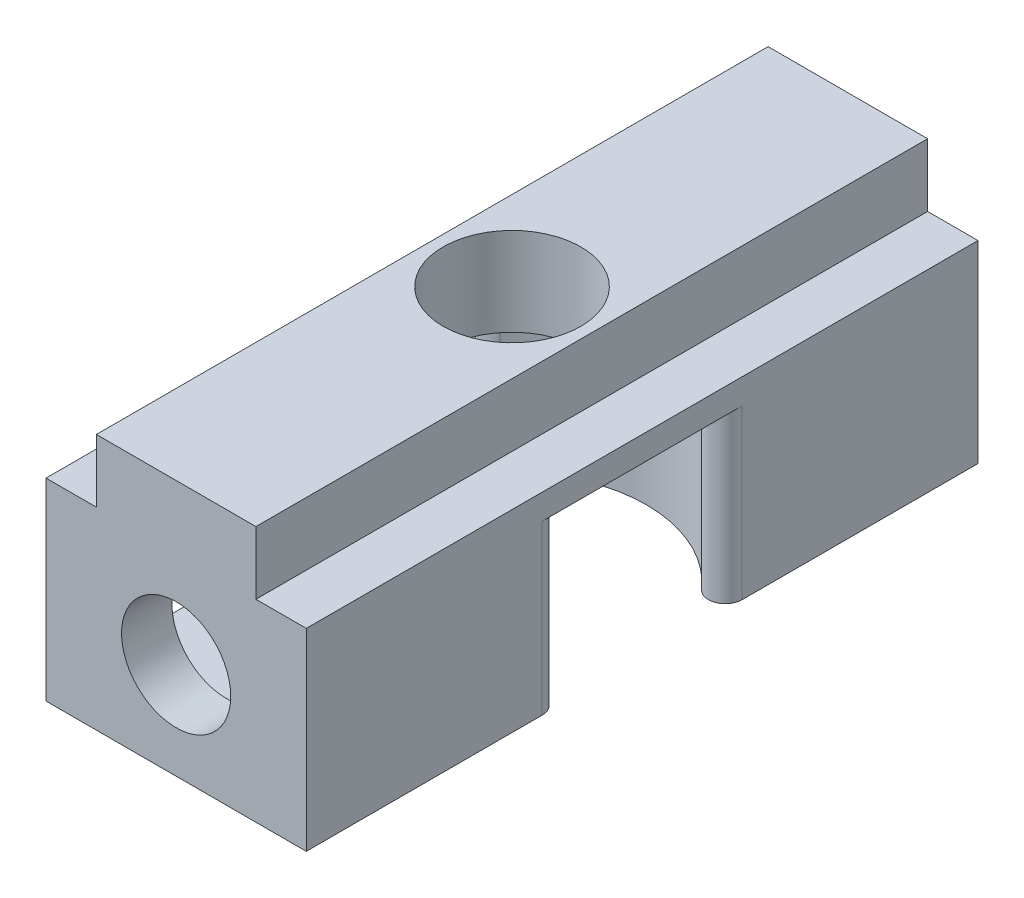
ISO-10303-21;
HEADER;
FILE_DESCRIPTION(('STEP AP214'),'2;1');
FILE_NAME('part.step','',(''),(''),'','','');
FILE_SCHEMA(('AUTOMOTIVE_DESIGN { 1 0 10303 214 1 1 1 1 }'));
ENDSEC;
DATA;
#1=APPLICATION_CONTEXT('core data for automotive mechanical design processes');
#2=APPLICATION_PROTOCOL_DEFINITION('international standard','automotive_design',2000,#1);
#3=PRODUCT_CONTEXT('',#1,'mechanical');
#4=PRODUCT('Part','Part','',(#3));
#5=PRODUCT_RELATED_PRODUCT_CATEGORY('part','',(#4));
#6=PRODUCT_DEFINITION_FORMATION('','',#4);
#7=PRODUCT_DEFINITION_CONTEXT('part definition',#1,'design');
#8=PRODUCT_DEFINITION('design','',#6,#7);
#9=PRODUCT_DEFINITION_SHAPE('','',#8);
#10=(LENGTH_UNIT() NAMED_UNIT(*) SI_UNIT(.MILLI.,.METRE.));
#11=(NAMED_UNIT(*) PLANE_ANGLE_UNIT() SI_UNIT($,.RADIAN.));
#12=(NAMED_UNIT(*) SI_UNIT($,.STERADIAN.) SOLID_ANGLE_UNIT());
#13=UNCERTAINTY_MEASURE_WITH_UNIT(LENGTH_MEASURE(1.E-05),#10,'distance_accuracy_value','');
#14=(GEOMETRIC_REPRESENTATION_CONTEXT(3) GLOBAL_UNCERTAINTY_ASSIGNED_CONTEXT((#13)) GLOBAL_UNIT_ASSIGNED_CONTEXT((#10,
#11,#12)) REPRESENTATION_CONTEXT('',''));
#15=CARTESIAN_POINT('',(0.,0.,0.));
#16=DIRECTION('',(0.,0.,1.));
#17=DIRECTION('',(1.,0.,0.));
#18=AXIS2_PLACEMENT_3D('',#15,#16,#17);
#19=CARTESIAN_POINT('',(0.,0.,40.));
#20=DIRECTION('',(0.,1.,0.));
#21=DIRECTION('',(0.,0.,1.));
#22=AXIS2_PLACEMENT_3D('',#19,#20,#21);
#23=PLANE('',#22);
#24=DIRECTION('',(0.,0.,-1.));
#25=VECTOR('',#24,1.);
#26=CARTESIAN_POINT('',(0.,0.,40.));
#27=LINE('',#26,#25);
#28=CARTESIAN_POINT('',(0.,0.,14.0470595501047));
#29=VERTEX_POINT('',#28);
#30=CARTESIAN_POINT('',(0.,0.,0.));
#31=VERTEX_POINT('',#30);
#32=EDGE_CURVE('E306',#29,#31,#27,.T.);
#33=ORIENTED_EDGE('',*,*,#32,.F.);
#34=CARTESIAN_POINT('',(-1.,0.,14.0470595501047));
#35=DIRECTION('',(0.,1.,0.));
#36=DIRECTION('',(0.,0.,1.));
#37=AXIS2_PLACEMENT_3D('',#34,#35,#36);
#38=CIRCLE('',#37,1.);
#39=CARTESIAN_POINT('',(-1.75,0.,14.7084973778708));
#40=VERTEX_POINT('',#39);
#41=EDGE_CURVE('E379',#29,#40,#38,.F.);
#42=ORIENTED_EDGE('',*,*,#41,.T.);
#43=CARTESIAN_POINT('',(-7.75,0.,20.));
#44=DIRECTION('',(0.,-1.,0.));
#45=DIRECTION('',(0.,0.,-1.));
#46=AXIS2_PLACEMENT_3D('',#43,#44,#45);
#47=CIRCLE('',#46,8.);
#48=CARTESIAN_POINT('',(-13.75,0.,14.7084973778708));
#49=VERTEX_POINT('',#48);
#50=EDGE_CURVE('E256',#49,#40,#47,.T.);
#51=ORIENTED_EDGE('',*,*,#50,.F.);
#52=CARTESIAN_POINT('',(-14.5,0.,14.0470595501047));
#53=DIRECTION('',(0.,1.,0.));
#54=DIRECTION('',(0.,0.,1.));
#55=AXIS2_PLACEMENT_3D('',#52,#53,#54);
#56=CIRCLE('',#55,1.);
#57=CARTESIAN_POINT('',(-15.5,0.,14.0470595501047));
#58=VERTEX_POINT('',#57);
#59=EDGE_CURVE('E376',#49,#58,#56,.F.);
#60=ORIENTED_EDGE('',*,*,#59,.T.);
#61=DIRECTION('',(0.,0.,-1.));
#62=VECTOR('',#61,1.);
#63=CARTESIAN_POINT('',(-15.5,0.,40.));
#64=LINE('',#63,#62);
#65=CARTESIAN_POINT('',(-15.5,0.,0.));
#66=VERTEX_POINT('',#65);
#67=EDGE_CURVE('E336',#58,#66,#64,.T.);
#68=ORIENTED_EDGE('',*,*,#67,.T.);
#69=DIRECTION('',(1.,0.,0.));
#70=VECTOR('',#69,1.);
#71=CARTESIAN_POINT('',(0.,0.,0.));
#72=LINE('',#71,#70);
#73=EDGE_CURVE('E285',#66,#31,#72,.T.);
#74=ORIENTED_EDGE('',*,*,#73,.T.);
#75=EDGE_LOOP('',(#33,#42,#51,#60,#68,#74));
#76=FACE_BOUND('',#75,.T.);
#77=ADVANCED_FACE('F45',(#76),#23,.F.);
#78=CARTESIAN_POINT('',(-7.75,-0.000999999999999265,20.));
#79=DIRECTION('',(0.,1.,0.));
#80=DIRECTION('',(0.,0.,1.));
#81=AXIS2_PLACEMENT_3D('',#78,#79,#80);
#82=CYLINDRICAL_SURFACE('',#81,4.1);
#83=CARTESIAN_POINT('',(-7.75,15.25,20.));
#84=DIRECTION('',(0.,1.,0.));
#85=DIRECTION('',(0.,0.,1.));
#86=AXIS2_PLACEMENT_3D('',#83,#84,#85);
#87=CIRCLE('',#86,4.1);
#88=CARTESIAN_POINT('',(-7.75,15.25,24.1));
#89=VERTEX_POINT('',#88);
#90=EDGE_CURVE('E275',#89,#89,#87,.T.);
#91=ORIENTED_EDGE('',*,*,#90,.T.);
#92=EDGE_LOOP('',(#91));
#93=FACE_BOUND('',#92,.T.);
#94=CARTESIAN_POINT('',(-7.75,10.,20.));
#95=DIRECTION('',(0.,-1.,0.));
#96=DIRECTION('',(0.,0.,-1.));
#97=AXIS2_PLACEMENT_3D('',#94,#95,#96);
#98=CIRCLE('',#97,4.1);
#99=CARTESIAN_POINT('',(-7.75,10.,15.9));
#100=VERTEX_POINT('',#99);
#101=EDGE_CURVE('E264',#100,#100,#98,.F.);
#102=ORIENTED_EDGE('',*,*,#101,.F.);
#103=EDGE_LOOP('',(#102));
#104=FACE_BOUND('',#103,.T.);
#105=ADVANCED_FACE('F481',(#93,#104),#82,.F.);
#106=CARTESIAN_POINT('',(0.,11.5,40.));
#107=DIRECTION('',(-1.,0.,0.));
#108=DIRECTION('',(0.,0.,1.));
#109=AXIS2_PLACEMENT_3D('',#106,#107,#108);
#110=PLANE('',#109);
#111=DIRECTION('',(0.,0.,1.));
#112=VECTOR('',#111,1.);
#113=CARTESIAN_POINT('',(0.,10.,40.));
#114=LINE('',#113,#112);
#115=CARTESIAN_POINT('',(0.,10.,14.0470595501047));
#116=VERTEX_POINT('',#115);
#117=CARTESIAN_POINT('',(0.,10.,25.9529404498953));
#118=VERTEX_POINT('',#117);
#119=EDGE_CURVE('E272',#116,#118,#114,.T.);
#120=ORIENTED_EDGE('',*,*,#119,.F.);
#121=DIRECTION('',(0.,-1.,0.));
#122=VECTOR('',#121,1.);
#123=CARTESIAN_POINT('',(0.,11.5,14.0470595501047));
#124=LINE('',#123,#122);
#125=EDGE_CURVE('E372',#116,#29,#124,.T.);
#126=ORIENTED_EDGE('',*,*,#125,.T.);
#127=ORIENTED_EDGE('',*,*,#32,.T.);
#128=DIRECTION('',(0.,1.,0.));
#129=VECTOR('',#128,1.);
#130=CARTESIAN_POINT('',(0.,11.5,0.));
#131=LINE('',#130,#129);
#132=CARTESIAN_POINT('',(0.,11.5,0.));
#133=VERTEX_POINT('',#132);
#134=EDGE_CURVE('E279',#31,#133,#131,.T.);
#135=ORIENTED_EDGE('',*,*,#134,.T.);
#136=DIRECTION('',(0.,0.,-1.));
#137=VECTOR('',#136,1.);
#138=CARTESIAN_POINT('',(0.,11.5,40.));
#139=LINE('',#138,#137);
#140=CARTESIAN_POINT('',(0.,11.5,40.));
#141=VERTEX_POINT('',#140);
#142=EDGE_CURVE('E361',#141,#133,#139,.T.);
#143=ORIENTED_EDGE('',*,*,#142,.F.);
#144=DIRECTION('',(0.,1.,0.));
#145=VECTOR('',#144,1.);
#146=CARTESIAN_POINT('',(0.,11.5,40.));
#147=LINE('',#146,#145);
#148=CARTESIAN_POINT('',(0.,0.,40.));
#149=VERTEX_POINT('',#148);
#150=EDGE_CURVE('E280',#149,#141,#147,.T.);
#151=ORIENTED_EDGE('',*,*,#150,.F.);
#152=CARTESIAN_POINT('',(0.,0.,25.9529404498953));
#153=VERTEX_POINT('',#152);
#154=EDGE_CURVE('E332',#149,#153,#27,.T.);
#155=ORIENTED_EDGE('',*,*,#154,.T.);
#156=DIRECTION('',(0.,-1.,0.));
#157=VECTOR('',#156,1.);
#158=CARTESIAN_POINT('',(0.,11.5,25.9529404498953));
#159=LINE('',#158,#157);
#160=EDGE_CURVE('E365',#153,#118,#159,.F.);
#161=ORIENTED_EDGE('',*,*,#160,.T.);
#162=EDGE_LOOP('',(#120,#126,#127,#135,#143,#151,#155,#161));
#163=FACE_BOUND('',#162,.T.);
#164=ADVANCED_FACE('F431',(#163),#110,.F.);
#165=CARTESIAN_POINT('',(-3.,11.5,40.));
#166=DIRECTION('',(0.,-1.,0.));
#167=DIRECTION('',(0.,0.,-1.));
#168=AXIS2_PLACEMENT_3D('',#165,#166,#167);
#169=PLANE('',#168);
#170=DIRECTION('',(-1.,0.,0.));
#171=VECTOR('',#170,1.);
#172=CARTESIAN_POINT('',(-3.,11.5,0.));
#173=LINE('',#172,#171);
#174=CARTESIAN_POINT('',(-3.,11.5,0.));
#175=VERTEX_POINT('',#174);
#176=EDGE_CURVE('E310',#133,#175,#173,.T.);
#177=ORIENTED_EDGE('',*,*,#176,.T.);
#178=DIRECTION('',(0.,0.,-1.));
#179=VECTOR('',#178,1.);
#180=CARTESIAN_POINT('',(-3.,11.5,40.));
#181=LINE('',#180,#179);
#182=CARTESIAN_POINT('',(-3.,11.5,40.));
#183=VERTEX_POINT('',#182);
#184=EDGE_CURVE('E357',#183,#175,#181,.T.);
#185=ORIENTED_EDGE('',*,*,#184,.F.);
#186=DIRECTION('',(-1.,0.,0.));
#187=VECTOR('',#186,1.);
#188=CARTESIAN_POINT('',(-3.,11.5,40.));
#189=LINE('',#188,#187);
#190=EDGE_CURVE('E284',#141,#183,#189,.T.);
#191=ORIENTED_EDGE('',*,*,#190,.F.);
#192=ORIENTED_EDGE('',*,*,#142,.T.);
#193=EDGE_LOOP('',(#177,#185,#191,#192));
#194=FACE_BOUND('',#193,.T.);
#195=ADVANCED_FACE('F506',(#194),#169,.F.);
#196=CARTESIAN_POINT('',(-3.,15.25,40.));
#197=DIRECTION('',(-1.,0.,0.));
#198=DIRECTION('',(0.,0.,1.));
#199=AXIS2_PLACEMENT_3D('',#196,#197,#198);
#200=PLANE('',#199);
#201=DIRECTION('',(0.,1.,0.));
#202=VECTOR('',#201,1.);
#203=CARTESIAN_POINT('',(-3.,15.25,0.));
#204=LINE('',#203,#202);
#205=CARTESIAN_POINT('',(-3.,15.25,0.));
#206=VERTEX_POINT('',#205);
#207=EDGE_CURVE('E313',#175,#206,#204,.T.);
#208=ORIENTED_EDGE('',*,*,#207,.T.);
#209=DIRECTION('',(0.,0.,-1.));
#210=VECTOR('',#209,1.);
#211=CARTESIAN_POINT('',(-3.,15.25,40.));
#212=LINE('',#211,#210);
#213=CARTESIAN_POINT('',(-3.,15.25,40.));
#214=VERTEX_POINT('',#213);
#215=EDGE_CURVE('E353',#214,#206,#212,.T.);
#216=ORIENTED_EDGE('',*,*,#215,.F.);
#217=DIRECTION('',(0.,1.,0.));
#218=VECTOR('',#217,1.);
#219=CARTESIAN_POINT('',(-3.,15.25,40.));
#220=LINE('',#219,#218);
#221=EDGE_CURVE('E288',#183,#214,#220,.T.);
#222=ORIENTED_EDGE('',*,*,#221,.F.);
#223=ORIENTED_EDGE('',*,*,#184,.T.);
#224=EDGE_LOOP('',(#208,#216,#222,#223));
#225=FACE_BOUND('',#224,.T.);
#226=ADVANCED_FACE('F502',(#225),#200,.F.);
#227=CARTESIAN_POINT('',(-12.5,15.25,40.));
#228=DIRECTION('',(0.,-1.,0.));
#229=DIRECTION('',(0.,0.,-1.));
#230=AXIS2_PLACEMENT_3D('',#227,#228,#229);
#231=PLANE('',#230);
#232=ORIENTED_EDGE('',*,*,#90,.F.);
#233=EDGE_LOOP('',(#232));
#234=FACE_BOUND('',#233,.T.);
#235=DIRECTION('',(-1.,0.,0.));
#236=VECTOR('',#235,1.);
#237=CARTESIAN_POINT('',(-12.5,15.25,0.));
#238=LINE('',#237,#236);
#239=CARTESIAN_POINT('',(-12.5,15.25,0.));
#240=VERTEX_POINT('',#239);
#241=EDGE_CURVE('E316',#206,#240,#238,.T.);
#242=ORIENTED_EDGE('',*,*,#241,.T.);
#243=DIRECTION('',(0.,0.,-1.));
#244=VECTOR('',#243,1.);
#245=CARTESIAN_POINT('',(-12.5,15.25,40.));
#246=LINE('',#245,#244);
#247=CARTESIAN_POINT('',(-12.5,15.25,40.));
#248=VERTEX_POINT('',#247);
#249=EDGE_CURVE('E349',#248,#240,#246,.T.);
#250=ORIENTED_EDGE('',*,*,#249,.F.);
#251=DIRECTION('',(-1.,0.,0.));
#252=VECTOR('',#251,1.);
#253=CARTESIAN_POINT('',(-12.5,15.25,40.));
#254=LINE('',#253,#252);
#255=EDGE_CURVE('E291',#214,#248,#254,.T.);
#256=ORIENTED_EDGE('',*,*,#255,.F.);
#257=ORIENTED_EDGE('',*,*,#215,.T.);
#258=EDGE_LOOP('',(#242,#250,#256,#257));
#259=FACE_BOUND('',#258,.T.);
#260=ADVANCED_FACE('F498',(#234,#259),#231,.F.);
#261=CARTESIAN_POINT('',(-12.5,11.5,40.));
#262=DIRECTION('',(1.,0.,0.));
#263=DIRECTION('',(0.,0.,-1.));
#264=AXIS2_PLACEMENT_3D('',#261,#262,#263);
#265=PLANE('',#264);
#266=DIRECTION('',(0.,-1.,0.));
#267=VECTOR('',#266,1.);
#268=CARTESIAN_POINT('',(-12.5,11.5,0.));
#269=LINE('',#268,#267);
#270=CARTESIAN_POINT('',(-12.5,11.5,0.));
#271=VERTEX_POINT('',#270);
#272=EDGE_CURVE('E319',#240,#271,#269,.T.);
#273=ORIENTED_EDGE('',*,*,#272,.T.);
#274=DIRECTION('',(0.,0.,-1.));
#275=VECTOR('',#274,1.);
#276=CARTESIAN_POINT('',(-12.5,11.5,40.));
#277=LINE('',#276,#275);
#278=CARTESIAN_POINT('',(-12.5,11.5,40.));
#279=VERTEX_POINT('',#278);
#280=EDGE_CURVE('E345',#279,#271,#277,.T.);
#281=ORIENTED_EDGE('',*,*,#280,.F.);
#282=DIRECTION('',(0.,-1.,0.));
#283=VECTOR('',#282,1.);
#284=CARTESIAN_POINT('',(-12.5,11.5,40.));
#285=LINE('',#284,#283);
#286=EDGE_CURVE('E294',#248,#279,#285,.T.);
#287=ORIENTED_EDGE('',*,*,#286,.F.);
#288=ORIENTED_EDGE('',*,*,#249,.T.);
#289=EDGE_LOOP('',(#273,#281,#287,#288));
#290=FACE_BOUND('',#289,.T.);
#291=ADVANCED_FACE('F494',(#290),#265,.F.);
#292=CARTESIAN_POINT('',(-15.5,11.5,40.));
#293=DIRECTION('',(0.,-1.,0.));
#294=DIRECTION('',(0.,0.,-1.));
#295=AXIS2_PLACEMENT_3D('',#292,#293,#294);
#296=PLANE('',#295);
#297=DIRECTION('',(-1.,0.,0.));
#298=VECTOR('',#297,1.);
#299=CARTESIAN_POINT('',(-15.5,11.5,0.));
#300=LINE('',#299,#298);
#301=CARTESIAN_POINT('',(-15.5,11.5,0.));
#302=VERTEX_POINT('',#301);
#303=EDGE_CURVE('E322',#271,#302,#300,.T.);
#304=ORIENTED_EDGE('',*,*,#303,.T.);
#305=DIRECTION('',(0.,0.,-1.));
#306=VECTOR('',#305,1.);
#307=CARTESIAN_POINT('',(-15.5,11.5,40.));
#308=LINE('',#307,#306);
#309=CARTESIAN_POINT('',(-15.5,11.5,40.));
#310=VERTEX_POINT('',#309);
#311=EDGE_CURVE('E341',#310,#302,#308,.T.);
#312=ORIENTED_EDGE('',*,*,#311,.F.);
#313=DIRECTION('',(-1.,0.,0.));
#314=VECTOR('',#313,1.);
#315=CARTESIAN_POINT('',(-15.5,11.5,40.));
#316=LINE('',#315,#314);
#317=EDGE_CURVE('E297',#279,#310,#316,.T.);
#318=ORIENTED_EDGE('',*,*,#317,.F.);
#319=ORIENTED_EDGE('',*,*,#280,.T.);
#320=EDGE_LOOP('',(#304,#312,#318,#319));
#321=FACE_BOUND('',#320,.T.);
#322=ADVANCED_FACE('F491',(#321),#296,.F.);
#323=CARTESIAN_POINT('',(-15.5,0.,40.));
#324=DIRECTION('',(1.,0.,0.));
#325=DIRECTION('',(0.,0.,-1.));
#326=AXIS2_PLACEMENT_3D('',#323,#324,#325);
#327=PLANE('',#326);
#328=DIRECTION('',(0.,-1.,0.));
#329=VECTOR('',#328,1.);
#330=CARTESIAN_POINT('',(-15.5,10.75,31.));
#331=LINE('',#330,#329);
#332=CARTESIAN_POINT('',(-15.5,10.75,31.));
#333=VERTEX_POINT('',#332);
#334=CARTESIAN_POINT('',(-15.5,0.75,31.));
#335=VERTEX_POINT('',#334);
#336=EDGE_CURVE('E220',#333,#335,#331,.T.);
#337=ORIENTED_EDGE('',*,*,#336,.F.);
#338=DIRECTION('',(0.,0.,-1.));
#339=VECTOR('',#338,1.);
#340=CARTESIAN_POINT('',(-15.5,10.75,37.));
#341=LINE('',#340,#339);
#342=CARTESIAN_POINT('',(-15.5,10.75,37.));
#343=VERTEX_POINT('',#342);
#344=EDGE_CURVE('E196',#343,#333,#341,.T.);
#345=ORIENTED_EDGE('',*,*,#344,.F.);
#346=DIRECTION('',(0.,1.,0.));
#347=VECTOR('',#346,1.);
#348=CARTESIAN_POINT('',(-15.5,10.75,37.));
#349=LINE('',#348,#347);
#350=CARTESIAN_POINT('',(-15.5,0.75,37.));
#351=VERTEX_POINT('',#350);
#352=EDGE_CURVE('E207',#351,#343,#349,.T.);
#353=ORIENTED_EDGE('',*,*,#352,.F.);
#354=DIRECTION('',(0.,0.,1.));
#355=VECTOR('',#354,1.);
#356=CARTESIAN_POINT('',(-15.5,0.75,37.));
#357=LINE('',#356,#355);
#358=EDGE_CURVE('E216',#335,#351,#357,.T.);
#359=ORIENTED_EDGE('',*,*,#358,.F.);
#360=EDGE_LOOP('',(#337,#345,#353,#359));
#361=FACE_BOUND('',#360,.T.);
#362=ORIENTED_EDGE('',*,*,#67,.F.);
#363=DIRECTION('',(0.,-1.,0.));
#364=VECTOR('',#363,1.);
#365=CARTESIAN_POINT('',(-15.5,0.,14.0470595501047));
#366=LINE('',#365,#364);
#367=CARTESIAN_POINT('',(-15.5,10.,14.0470595501047));
#368=VERTEX_POINT('',#367);
#369=EDGE_CURVE('E392',#58,#368,#366,.F.);
#370=ORIENTED_EDGE('',*,*,#369,.T.);
#371=DIRECTION('',(0.,0.,-1.));
#372=VECTOR('',#371,1.);
#373=CARTESIAN_POINT('',(-15.5,10.,40.));
#374=LINE('',#373,#372);
#375=CARTESIAN_POINT('',(-15.5,10.,25.9529404498953));
#376=VERTEX_POINT('',#375);
#377=EDGE_CURVE('E269',#376,#368,#374,.T.);
#378=ORIENTED_EDGE('',*,*,#377,.F.);
#379=DIRECTION('',(0.,-1.,0.));
#380=VECTOR('',#379,1.);
#381=CARTESIAN_POINT('',(-15.5,0.,25.9529404498953));
#382=LINE('',#381,#380);
#383=CARTESIAN_POINT('',(-15.5,0.,25.9529404498953));
#384=VERTEX_POINT('',#383);
#385=EDGE_CURVE('E388',#376,#384,#382,.T.);
#386=ORIENTED_EDGE('',*,*,#385,.T.);
#387=CARTESIAN_POINT('',(-15.5,0.,40.));
#388=VERTEX_POINT('',#387);
#389=EDGE_CURVE('E337',#388,#384,#64,.T.);
#390=ORIENTED_EDGE('',*,*,#389,.F.);
#391=DIRECTION('',(0.,-1.,0.));
#392=VECTOR('',#391,1.);
#393=CARTESIAN_POINT('',(-15.5,0.,40.));
#394=LINE('',#393,#392);
#395=EDGE_CURVE('E300',#310,#388,#394,.T.);
#396=ORIENTED_EDGE('',*,*,#395,.F.);
#397=ORIENTED_EDGE('',*,*,#311,.T.);
#398=DIRECTION('',(0.,-1.,0.));
#399=VECTOR('',#398,1.);
#400=CARTESIAN_POINT('',(-15.5,0.,0.));
#401=LINE('',#400,#399);
#402=EDGE_CURVE('E325',#302,#66,#401,.T.);
#403=ORIENTED_EDGE('',*,*,#402,.T.);
#404=EDGE_LOOP('',(#362,#370,#378,#386,#390,#396,#397,#403));
#405=FACE_BOUND('',#404,.T.);
#406=ADVANCED_FACE('F218',(#361,#405),#327,.F.);
#407=CARTESIAN_POINT('',(-1.75,0.,25.2915026221292));
#408=VERTEX_POINT('',#407);
#409=CARTESIAN_POINT('',(-13.75,0.,25.2915026221292));
#410=VERTEX_POINT('',#409);
#411=EDGE_CURVE('E266',#408,#410,#47,.T.);
#412=ORIENTED_EDGE('',*,*,#411,.F.);
#413=CARTESIAN_POINT('',(-1.,0.,25.9529404498953));
#414=DIRECTION('',(0.,1.,0.));
#415=DIRECTION('',(0.,0.,1.));
#416=AXIS2_PLACEMENT_3D('',#413,#414,#415);
#417=CIRCLE('',#416,1.);
#418=EDGE_CURVE('E404',#408,#153,#417,.F.);
#419=ORIENTED_EDGE('',*,*,#418,.T.);
#420=ORIENTED_EDGE('',*,*,#154,.F.);
#421=DIRECTION('',(1.,0.,0.));
#422=VECTOR('',#421,1.);
#423=CARTESIAN_POINT('',(0.,0.,40.));
#424=LINE('',#423,#422);
#425=EDGE_CURVE('E303',#388,#149,#424,.T.);
#426=ORIENTED_EDGE('',*,*,#425,.F.);
#427=ORIENTED_EDGE('',*,*,#389,.T.);
#428=CARTESIAN_POINT('',(-14.5,0.,25.9529404498953));
#429=DIRECTION('',(0.,1.,0.));
#430=DIRECTION('',(0.,0.,1.));
#431=AXIS2_PLACEMENT_3D('',#428,#429,#430);
#432=CIRCLE('',#431,1.);
#433=EDGE_CURVE('E401',#384,#410,#432,.F.);
#434=ORIENTED_EDGE('',*,*,#433,.T.);
#435=EDGE_LOOP('',(#412,#419,#420,#426,#427,#434));
#436=FACE_BOUND('',#435,.T.);
#437=ADVANCED_FACE('F427',(#436),#23,.F.);
#438=CARTESIAN_POINT('',(0.,0.,40.));
#439=DIRECTION('',(0.,0.,-1.));
#440=DIRECTION('',(-1.,0.,0.));
#441=AXIS2_PLACEMENT_3D('',#438,#439,#440);
#442=PLANE('',#441);
#443=CARTESIAN_POINT('',(-7.75,5.75,40.));
#444=DIRECTION('',(0.,0.,1.));
#445=DIRECTION('',(1.,0.,0.));
#446=AXIS2_PLACEMENT_3D('',#443,#444,#445);
#447=CIRCLE('',#446,3.25);
#448=CARTESIAN_POINT('',(-4.5,5.75,40.));
#449=VERTEX_POINT('',#448);
#450=EDGE_CURVE('E228',#449,#449,#447,.T.);
#451=ORIENTED_EDGE('',*,*,#450,.F.);
#452=EDGE_LOOP('',(#451));
#453=FACE_BOUND('',#452,.T.);
#454=ORIENTED_EDGE('',*,*,#150,.T.);
#455=ORIENTED_EDGE('',*,*,#190,.T.);
#456=ORIENTED_EDGE('',*,*,#221,.T.);
#457=ORIENTED_EDGE('',*,*,#255,.T.);
#458=ORIENTED_EDGE('',*,*,#286,.T.);
#459=ORIENTED_EDGE('',*,*,#317,.T.);
#460=ORIENTED_EDGE('',*,*,#395,.T.);
#461=ORIENTED_EDGE('',*,*,#425,.T.);
#462=EDGE_LOOP('',(#454,#455,#456,#457,#458,#459,#460,#461));
#463=FACE_BOUND('',#462,.T.);
#464=ADVANCED_FACE('F434',(#453,#463),#442,.F.);
#465=CARTESIAN_POINT('',(0.,0.,0.));
#466=DIRECTION('',(0.,0.,-1.));
#467=DIRECTION('',(-1.,0.,0.));
#468=AXIS2_PLACEMENT_3D('',#465,#466,#467);
#469=PLANE('',#468);
#470=ORIENTED_EDGE('',*,*,#134,.F.);
#471=ORIENTED_EDGE('',*,*,#73,.F.);
#472=ORIENTED_EDGE('',*,*,#402,.F.);
#473=ORIENTED_EDGE('',*,*,#303,.F.);
#474=ORIENTED_EDGE('',*,*,#272,.F.);
#475=ORIENTED_EDGE('',*,*,#241,.F.);
#476=ORIENTED_EDGE('',*,*,#207,.F.);
#477=ORIENTED_EDGE('',*,*,#176,.F.);
#478=EDGE_LOOP('',(#470,#471,#472,#473,#474,#475,#476,#477));
#479=FACE_BOUND('',#478,.T.);
#480=ADVANCED_FACE('F467',(#479),#469,.T.);
#481=CARTESIAN_POINT('',(-7.75,10.,20.));
#482=DIRECTION('',(0.,-1.,0.));
#483=DIRECTION('',(0.,0.,-1.));
#484=AXIS2_PLACEMENT_3D('',#481,#482,#483);
#485=CYLINDRICAL_SURFACE('',#484,8.);
#486=ORIENTED_EDGE('',*,*,#50,.T.);
#487=DIRECTION('',(0.,-1.,0.));
#488=VECTOR('',#487,1.);
#489=CARTESIAN_POINT('',(-1.75,10.,14.7084973778708));
#490=LINE('',#489,#488);
#491=CARTESIAN_POINT('',(-1.75,10.,14.7084973778708));
#492=VERTEX_POINT('',#491);
#493=EDGE_CURVE('E385',#40,#492,#490,.F.);
#494=ORIENTED_EDGE('',*,*,#493,.T.);
#495=CARTESIAN_POINT('',(-7.75,10.,20.));
#496=DIRECTION('',(0.,-1.,0.));
#497=DIRECTION('',(0.,0.,-1.));
#498=AXIS2_PLACEMENT_3D('',#495,#496,#497);
#499=CIRCLE('',#498,8.);
#500=CARTESIAN_POINT('',(-13.75,10.,14.7084973778708));
#501=VERTEX_POINT('',#500);
#502=EDGE_CURVE('E265',#501,#492,#499,.T.);
#503=ORIENTED_EDGE('',*,*,#502,.F.);
#504=DIRECTION('',(0.,-1.,0.));
#505=VECTOR('',#504,1.);
#506=CARTESIAN_POINT('',(-13.75,10.,14.7084973778708));
#507=LINE('',#506,#505);
#508=EDGE_CURVE('E382',#501,#49,#507,.T.);
#509=ORIENTED_EDGE('',*,*,#508,.T.);
#510=EDGE_LOOP('',(#486,#494,#503,#509));
#511=FACE_BOUND('',#510,.T.);
#512=ADVANCED_FACE('F474',(#511),#485,.F.);
#513=CARTESIAN_POINT('',(-1.75,10.,25.2915026221292));
#514=VERTEX_POINT('',#513);
#515=CARTESIAN_POINT('',(-13.75,10.,25.2915026221292));
#516=VERTEX_POINT('',#515);
#517=EDGE_CURVE('E261',#514,#516,#499,.T.);
#518=ORIENTED_EDGE('',*,*,#517,.F.);
#519=DIRECTION('',(0.,-1.,0.));
#520=VECTOR('',#519,1.);
#521=CARTESIAN_POINT('',(-1.75,10.,25.2915026221292));
#522=LINE('',#521,#520);
#523=EDGE_CURVE('E398',#514,#408,#522,.T.);
#524=ORIENTED_EDGE('',*,*,#523,.T.);
#525=ORIENTED_EDGE('',*,*,#411,.T.);
#526=DIRECTION('',(0.,-1.,0.));
#527=VECTOR('',#526,1.);
#528=CARTESIAN_POINT('',(-13.75,10.,25.2915026221292));
#529=LINE('',#528,#527);
#530=EDGE_CURVE('E69',#410,#516,#529,.F.);
#531=ORIENTED_EDGE('',*,*,#530,.T.);
#532=EDGE_LOOP('',(#518,#524,#525,#531));
#533=FACE_BOUND('',#532,.T.);
#534=ADVANCED_FACE('F421',(#533),#485,.F.);
#535=CARTESIAN_POINT('',(-7.75,10.,20.));
#536=DIRECTION('',(0.,-1.,0.));
#537=DIRECTION('',(0.,0.,-1.));
#538=AXIS2_PLACEMENT_3D('',#535,#536,#537);
#539=PLANE('',#538);
#540=ORIENTED_EDGE('',*,*,#101,.T.);
#541=EDGE_LOOP('',(#540));
#542=FACE_BOUND('',#541,.T.);
#543=ORIENTED_EDGE('',*,*,#119,.T.);
#544=CARTESIAN_POINT('',(-1.,10.,25.9529404498953));
#545=DIRECTION('',(0.,-1.,0.));
#546=DIRECTION('',(0.,0.,-1.));
#547=AXIS2_PLACEMENT_3D('',#544,#545,#546);
#548=CIRCLE('',#547,1.);
#549=EDGE_CURVE('E54',#118,#514,#548,.F.);
#550=ORIENTED_EDGE('',*,*,#549,.T.);
#551=ORIENTED_EDGE('',*,*,#517,.T.);
#552=CARTESIAN_POINT('',(-14.5,10.,25.9529404498953));
#553=DIRECTION('',(0.,-1.,0.));
#554=DIRECTION('',(0.,0.,-1.));
#555=AXIS2_PLACEMENT_3D('',#552,#553,#554);
#556=CIRCLE('',#555,1.);
#557=EDGE_CURVE('E11',#516,#376,#556,.F.);
#558=ORIENTED_EDGE('',*,*,#557,.T.);
#559=ORIENTED_EDGE('',*,*,#377,.T.);
#560=CARTESIAN_POINT('',(-14.5,10.,14.0470595501047));
#561=DIRECTION('',(0.,-1.,0.));
#562=DIRECTION('',(0.,0.,-1.));
#563=AXIS2_PLACEMENT_3D('',#560,#561,#562);
#564=CIRCLE('',#563,1.);
#565=EDGE_CURVE('E411',#368,#501,#564,.F.);
#566=ORIENTED_EDGE('',*,*,#565,.T.);
#567=ORIENTED_EDGE('',*,*,#502,.T.);
#568=CARTESIAN_POINT('',(-1.,10.,14.0470595501047));
#569=DIRECTION('',(0.,-1.,0.));
#570=DIRECTION('',(0.,0.,-1.));
#571=AXIS2_PLACEMENT_3D('',#568,#569,#570);
#572=CIRCLE('',#571,1.);
#573=EDGE_CURVE('E407',#492,#116,#572,.F.);
#574=ORIENTED_EDGE('',*,*,#573,.T.);
#575=EDGE_LOOP('',(#543,#550,#551,#558,#559,#566,#567,#574));
#576=FACE_BOUND('',#575,.T.);
#577=ADVANCED_FACE('F416',(#542,#576),#539,.T.);
#578=CARTESIAN_POINT('',(-1.,10.,14.0470595501047));
#579=DIRECTION('',(0.,-1.,0.));
#580=DIRECTION('',(0.,0.,-1.));
#581=AXIS2_PLACEMENT_3D('',#578,#579,#580);
#582=CYLINDRICAL_SURFACE('',#581,1.);
#583=ORIENTED_EDGE('',*,*,#573,.F.);
#584=ORIENTED_EDGE('',*,*,#493,.F.);
#585=ORIENTED_EDGE('',*,*,#41,.F.);
#586=ORIENTED_EDGE('',*,*,#125,.F.);
#587=EDGE_LOOP('',(#583,#584,#585,#586));
#588=FACE_BOUND('',#587,.T.);
#589=ADVANCED_FACE('F512',(#588),#582,.T.);
#590=CARTESIAN_POINT('',(-14.5,10.,14.0470595501047));
#591=DIRECTION('',(0.,-1.,0.));
#592=DIRECTION('',(0.,0.,-1.));
#593=AXIS2_PLACEMENT_3D('',#590,#591,#592);
#594=CYLINDRICAL_SURFACE('',#593,1.);
#595=ORIENTED_EDGE('',*,*,#59,.F.);
#596=ORIENTED_EDGE('',*,*,#508,.F.);
#597=ORIENTED_EDGE('',*,*,#565,.F.);
#598=ORIENTED_EDGE('',*,*,#369,.F.);
#599=EDGE_LOOP('',(#595,#596,#597,#598));
#600=FACE_BOUND('',#599,.T.);
#601=ADVANCED_FACE('F448',(#600),#594,.T.);
#602=CARTESIAN_POINT('',(-1.,10.,25.9529404498953));
#603=DIRECTION('',(0.,-1.,0.));
#604=DIRECTION('',(0.,0.,-1.));
#605=AXIS2_PLACEMENT_3D('',#602,#603,#604);
#606=CYLINDRICAL_SURFACE('',#605,1.);
#607=ORIENTED_EDGE('',*,*,#418,.F.);
#608=ORIENTED_EDGE('',*,*,#523,.F.);
#609=ORIENTED_EDGE('',*,*,#549,.F.);
#610=ORIENTED_EDGE('',*,*,#160,.F.);
#611=EDGE_LOOP('',(#607,#608,#609,#610));
#612=FACE_BOUND('',#611,.T.);
#613=ADVANCED_FACE('F424',(#612),#606,.T.);
#614=CARTESIAN_POINT('',(-14.5,10.,25.9529404498953));
#615=DIRECTION('',(0.,-1.,0.));
#616=DIRECTION('',(0.,0.,-1.));
#617=AXIS2_PLACEMENT_3D('',#614,#615,#616);
#618=CYLINDRICAL_SURFACE('',#617,1.);
#619=ORIENTED_EDGE('',*,*,#557,.F.);
#620=ORIENTED_EDGE('',*,*,#530,.F.);
#621=ORIENTED_EDGE('',*,*,#433,.F.);
#622=ORIENTED_EDGE('',*,*,#385,.F.);
#623=EDGE_LOOP('',(#619,#620,#621,#622));
#624=FACE_BOUND('',#623,.T.);
#625=ADVANCED_FACE('F47',(#624),#618,.T.);
#626=CARTESIAN_POINT('',(-4.86324865405187,0.75,31.));
#627=DIRECTION('',(0.866025403784439,-0.5,0.));
#628=DIRECTION('',(0.5,0.866025403784439,0.));
#629=AXIS2_PLACEMENT_3D('',#626,#627,#628);
#630=PLANE('',#629);
#631=DIRECTION('',(0.5,0.866025403784439,0.));
#632=VECTOR('',#631,1.);
#633=CARTESIAN_POINT('',(-4.86324865405187,0.75,37.));
#634=LINE('',#633,#632);
#635=CARTESIAN_POINT('',(-4.86324865405187,0.75,37.));
#636=VERTEX_POINT('',#635);
#637=CARTESIAN_POINT('',(-1.97649730810374,5.75,37.));
#638=VERTEX_POINT('',#637);
#639=EDGE_CURVE('E215',#636,#638,#634,.T.);
#640=ORIENTED_EDGE('',*,*,#639,.T.);
#641=DIRECTION('',(0.,0.,1.));
#642=VECTOR('',#641,1.);
#643=CARTESIAN_POINT('',(-1.97649730810374,5.75,31.));
#644=LINE('',#643,#642);
#645=CARTESIAN_POINT('',(-1.97649730810374,5.75,31.));
#646=VERTEX_POINT('',#645);
#647=EDGE_CURVE('E245',#646,#638,#644,.T.);
#648=ORIENTED_EDGE('',*,*,#647,.F.);
#649=DIRECTION('',(0.5,0.866025403784439,0.));
#650=VECTOR('',#649,1.);
#651=CARTESIAN_POINT('',(-4.86324865405187,0.75,31.));
#652=LINE('',#651,#650);
#653=CARTESIAN_POINT('',(-4.86324865405187,0.75,31.));
#654=VERTEX_POINT('',#653);
#655=EDGE_CURVE('E232',#654,#646,#652,.T.);
#656=ORIENTED_EDGE('',*,*,#655,.F.);
#657=DIRECTION('',(0.,0.,1.));
#658=VECTOR('',#657,1.);
#659=CARTESIAN_POINT('',(-4.86324865405187,0.75,31.));
#660=LINE('',#659,#658);
#661=EDGE_CURVE('E253',#654,#636,#660,.T.);
#662=ORIENTED_EDGE('',*,*,#661,.T.);
#663=EDGE_LOOP('',(#640,#648,#656,#662));
#664=FACE_BOUND('',#663,.T.);
#665=ADVANCED_FACE('F521',(#664),#630,.F.);
#666=CARTESIAN_POINT('',(-10.6367513459481,0.749999999999999,31.));
#667=DIRECTION('',(0.,-1.,0.));
#668=DIRECTION('',(1.,0.,0.));
#669=AXIS2_PLACEMENT_3D('',#666,#667,#668);
#670=PLANE('',#669);
#671=DIRECTION('',(1.,0.,0.));
#672=VECTOR('',#671,1.);
#673=CARTESIAN_POINT('',(-10.6367513459481,0.749999999999999,37.));
#674=LINE('',#673,#672);
#675=EDGE_CURVE('E203',#351,#636,#674,.T.);
#676=ORIENTED_EDGE('',*,*,#675,.T.);
#677=ORIENTED_EDGE('',*,*,#661,.F.);
#678=DIRECTION('',(1.,0.,0.));
#679=VECTOR('',#678,1.);
#680=CARTESIAN_POINT('',(-10.6367513459481,0.749999999999999,31.));
#681=LINE('',#680,#679);
#682=EDGE_CURVE('E241',#335,#654,#681,.T.);
#683=ORIENTED_EDGE('',*,*,#682,.F.);
#684=ORIENTED_EDGE('',*,*,#358,.T.);
#685=EDGE_LOOP('',(#676,#677,#683,#684));
#686=FACE_BOUND('',#685,.T.);
#687=ADVANCED_FACE('F525',(#686),#670,.F.);
#688=CARTESIAN_POINT('',(-4.86324865405187,10.75,31.));
#689=DIRECTION('',(0.,1.,0.));
#690=DIRECTION('',(0.,0.,1.));
#691=AXIS2_PLACEMENT_3D('',#688,#689,#690);
#692=PLANE('',#691);
#693=DIRECTION('',(-1.,0.,0.));
#694=VECTOR('',#693,1.);
#695=CARTESIAN_POINT('',(-4.86324865405187,10.75,37.));
#696=LINE('',#695,#694);
#697=CARTESIAN_POINT('',(-4.86324865405187,10.75,37.));
#698=VERTEX_POINT('',#697);
#699=EDGE_CURVE('E192',#698,#343,#696,.T.);
#700=ORIENTED_EDGE('',*,*,#699,.T.);
#701=ORIENTED_EDGE('',*,*,#344,.T.);
#702=DIRECTION('',(-1.,0.,0.));
#703=VECTOR('',#702,1.);
#704=CARTESIAN_POINT('',(-4.86324865405187,10.75,31.));
#705=LINE('',#704,#703);
#706=CARTESIAN_POINT('',(-4.86324865405187,10.75,31.));
#707=VERTEX_POINT('',#706);
#708=EDGE_CURVE('E61',#707,#333,#705,.T.);
#709=ORIENTED_EDGE('',*,*,#708,.F.);
#710=DIRECTION('',(0.,0.,1.));
#711=VECTOR('',#710,1.);
#712=CARTESIAN_POINT('',(-4.86324865405187,10.75,31.));
#713=LINE('',#712,#711);
#714=EDGE_CURVE('E198',#707,#698,#713,.T.);
#715=ORIENTED_EDGE('',*,*,#714,.T.);
#716=EDGE_LOOP('',(#700,#701,#709,#715));
#717=FACE_BOUND('',#716,.T.);
#718=ADVANCED_FACE('F194',(#717),#692,.F.);
#719=CARTESIAN_POINT('',(-1.97649730810374,5.75,31.));
#720=DIRECTION('',(0.866025403784439,0.5,0.));
#721=DIRECTION('',(-0.5,0.866025403784439,0.));
#722=AXIS2_PLACEMENT_3D('',#719,#720,#721);
#723=PLANE('',#722);
#724=DIRECTION('',(-0.5,0.866025403784439,0.));
#725=VECTOR('',#724,1.);
#726=CARTESIAN_POINT('',(-1.97649730810374,5.75,37.));
#727=LINE('',#726,#725);
#728=EDGE_CURVE('E204',#638,#698,#727,.T.);
#729=ORIENTED_EDGE('',*,*,#728,.T.);
#730=ORIENTED_EDGE('',*,*,#714,.F.);
#731=DIRECTION('',(-0.5,0.866025403784439,0.));
#732=VECTOR('',#731,1.);
#733=CARTESIAN_POINT('',(-1.97649730810374,5.75,31.));
#734=LINE('',#733,#732);
#735=EDGE_CURVE('E236',#646,#707,#734,.T.);
#736=ORIENTED_EDGE('',*,*,#735,.F.);
#737=ORIENTED_EDGE('',*,*,#647,.T.);
#738=EDGE_LOOP('',(#729,#730,#736,#737));
#739=FACE_BOUND('',#738,.T.);
#740=ADVANCED_FACE('F535',(#739),#723,.F.);
#741=CARTESIAN_POINT('',(0.,0.,31.));
#742=DIRECTION('',(0.,0.,1.));
#743=DIRECTION('',(1.,0.,0.));
#744=AXIS2_PLACEMENT_3D('',#741,#742,#743);
#745=PLANE('',#744);
#746=ORIENTED_EDGE('',*,*,#336,.T.);
#747=ORIENTED_EDGE('',*,*,#682,.T.);
#748=ORIENTED_EDGE('',*,*,#655,.T.);
#749=ORIENTED_EDGE('',*,*,#735,.T.);
#750=ORIENTED_EDGE('',*,*,#708,.T.);
#751=EDGE_LOOP('',(#746,#747,#748,#749,#750));
#752=FACE_BOUND('',#751,.T.);
#753=ADVANCED_FACE('F620',(#752),#745,.T.);
#754=CARTESIAN_POINT('',(0.,0.,37.));
#755=DIRECTION('',(0.,0.,1.));
#756=DIRECTION('',(1.,0.,0.));
#757=AXIS2_PLACEMENT_3D('',#754,#755,#756);
#758=PLANE('',#757);
#759=CARTESIAN_POINT('',(-7.75,5.75,37.));
#760=DIRECTION('',(0.,0.,1.));
#761=DIRECTION('',(1.,0.,0.));
#762=AXIS2_PLACEMENT_3D('',#759,#760,#761);
#763=CIRCLE('',#762,3.25);
#764=CARTESIAN_POINT('',(-4.5,5.75,37.));
#765=VERTEX_POINT('',#764);
#766=EDGE_CURVE('E222',#765,#765,#763,.T.);
#767=ORIENTED_EDGE('',*,*,#766,.T.);
#768=EDGE_LOOP('',(#767));
#769=FACE_BOUND('',#768,.T.);
#770=ORIENTED_EDGE('',*,*,#675,.F.);
#771=ORIENTED_EDGE('',*,*,#352,.T.);
#772=ORIENTED_EDGE('',*,*,#699,.F.);
#773=ORIENTED_EDGE('',*,*,#728,.F.);
#774=ORIENTED_EDGE('',*,*,#639,.F.);
#775=EDGE_LOOP('',(#770,#771,#772,#773,#774));
#776=FACE_BOUND('',#775,.T.);
#777=ADVANCED_FACE('F208',(#769,#776),#758,.F.);
#778=CARTESIAN_POINT('',(-7.75,5.75,37.));
#779=DIRECTION('',(0.,0.,1.));
#780=DIRECTION('',(1.,0.,0.));
#781=AXIS2_PLACEMENT_3D('',#778,#779,#780);
#782=CYLINDRICAL_SURFACE('',#781,3.25);
#783=ORIENTED_EDGE('',*,*,#766,.F.);
#784=EDGE_LOOP('',(#783));
#785=FACE_BOUND('',#784,.T.);
#786=ORIENTED_EDGE('',*,*,#450,.T.);
#787=EDGE_LOOP('',(#786));
#788=FACE_BOUND('',#787,.T.);
#789=ADVANCED_FACE('F464',(#785,#788),#782,.F.);
#790=CLOSED_SHELL('',(#77,#105,#164,#195,#226,#260,#291,#322,#406,#437,#464,#480,#512,#534,#577,
#589,#601,#613,#625,#665,#687,#718,#740,#753,#777,#789));
#791=MANIFOLD_SOLID_BREP('B2',#790);
#792=ADVANCED_BREP_SHAPE_REPRESENTATION('',(#18,#791),#14);
#793=SHAPE_DEFINITION_REPRESENTATION(#9,#792);
ENDSEC;
END-ISO-10303-21;
